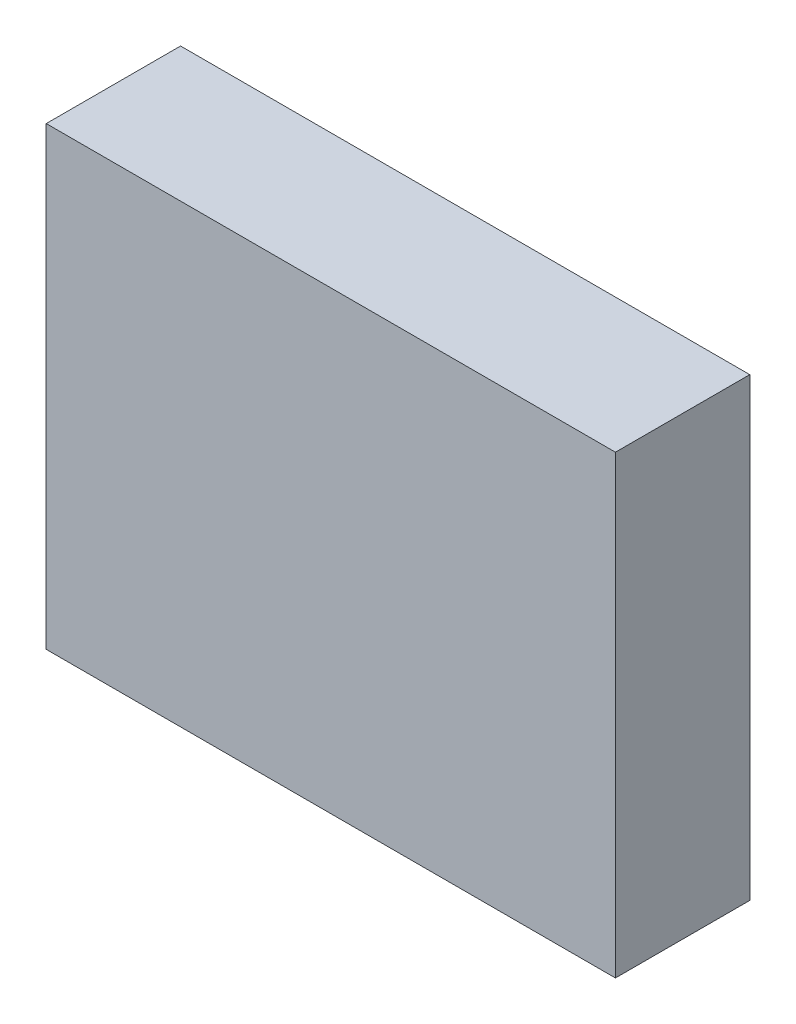
ISO-10303-21;
HEADER;
FILE_DESCRIPTION(('STEP AP214'),'2;1');
FILE_NAME('part.step','',(''),(''),'','','');
FILE_SCHEMA(('AUTOMOTIVE_DESIGN { 1 0 10303 214 1 1 1 1 }'));
ENDSEC;
DATA;
#1=APPLICATION_CONTEXT('core data for automotive mechanical design processes');
#2=APPLICATION_PROTOCOL_DEFINITION('international standard','automotive_design',2000,#1);
#3=PRODUCT_CONTEXT('',#1,'mechanical');
#4=PRODUCT('Part','Part','',(#3));
#5=PRODUCT_RELATED_PRODUCT_CATEGORY('part','',(#4));
#6=PRODUCT_DEFINITION_FORMATION('','',#4);
#7=PRODUCT_DEFINITION_CONTEXT('part definition',#1,'design');
#8=PRODUCT_DEFINITION('design','',#6,#7);
#9=PRODUCT_DEFINITION_SHAPE('','',#8);
#10=(LENGTH_UNIT() NAMED_UNIT(*) SI_UNIT(.MILLI.,.METRE.));
#11=(NAMED_UNIT(*) PLANE_ANGLE_UNIT() SI_UNIT($,.RADIAN.));
#12=(NAMED_UNIT(*) SI_UNIT($,.STERADIAN.) SOLID_ANGLE_UNIT());
#13=UNCERTAINTY_MEASURE_WITH_UNIT(LENGTH_MEASURE(1.E-05),#10,'distance_accuracy_value','');
#14=(GEOMETRIC_REPRESENTATION_CONTEXT(3) GLOBAL_UNCERTAINTY_ASSIGNED_CONTEXT((#13)) GLOBAL_UNIT_ASSIGNED_CONTEXT((#10,
#11,#12)) REPRESENTATION_CONTEXT('',''));
#15=CARTESIAN_POINT('',(0.,0.,0.));
#16=DIRECTION('',(0.,0.,1.));
#17=DIRECTION('',(1.,0.,0.));
#18=AXIS2_PLACEMENT_3D('',#15,#16,#17);
#19=CARTESIAN_POINT('',(-0.62500002,0.50000154,0.29499814));
#20=DIRECTION('',(0.,0.,1.));
#21=DIRECTION('',(1.,0.,0.));
#22=AXIS2_PLACEMENT_3D('',#19,#20,#21);
#23=PLANE('',#22);
#24=DIRECTION('',(0.,1.,0.));
#25=VECTOR('',#24,1.);
#26=CARTESIAN_POINT('',(0.62500002,0.50000154,0.29499814));
#27=LINE('',#26,#25);
#28=CARTESIAN_POINT('',(0.62500002,0.50000154,0.29499814));
#29=VERTEX_POINT('',#28);
#30=CARTESIAN_POINT('',(0.62500002,-0.499999,0.29499814));
#31=VERTEX_POINT('',#30);
#32=EDGE_CURVE('E52',#29,#31,#27,.F.);
#33=ORIENTED_EDGE('',*,*,#32,.F.);
#34=DIRECTION('',(1.,0.,0.));
#35=VECTOR('',#34,1.);
#36=CARTESIAN_POINT('',(-0.62500002,0.50000154,0.29499814));
#37=LINE('',#36,#35);
#38=CARTESIAN_POINT('',(-0.62500002,0.50000154,0.29499814));
#39=VERTEX_POINT('',#38);
#40=EDGE_CURVE('E67',#39,#29,#37,.T.);
#41=ORIENTED_EDGE('',*,*,#40,.F.);
#42=DIRECTION('',(0.,1.,0.));
#43=VECTOR('',#42,1.);
#44=CARTESIAN_POINT('',(-0.62500002,-0.499999,0.29499814));
#45=LINE('',#44,#43);
#46=CARTESIAN_POINT('',(-0.62500002,-0.499999,0.29499814));
#47=VERTEX_POINT('',#46);
#48=EDGE_CURVE('E19',#47,#39,#45,.T.);
#49=ORIENTED_EDGE('',*,*,#48,.F.);
#50=DIRECTION('',(1.,0.,0.));
#51=VECTOR('',#50,1.);
#52=CARTESIAN_POINT('',(0.62500002,-0.499999,0.29499814));
#53=LINE('',#52,#51);
#54=EDGE_CURVE('E57',#31,#47,#53,.F.);
#55=ORIENTED_EDGE('',*,*,#54,.F.);
#56=EDGE_LOOP('',(#33,#41,#49,#55));
#57=FACE_BOUND('',#56,.T.);
#58=ADVANCED_FACE('F16',(#57),#23,.T.);
#59=CARTESIAN_POINT('',(-0.62500002,-0.499999,0.));
#60=DIRECTION('',(-1.,0.,0.));
#61=DIRECTION('',(0.,0.,1.));
#62=AXIS2_PLACEMENT_3D('',#59,#60,#61);
#63=PLANE('',#62);
#64=DIRECTION('',(0.,0.,1.));
#65=VECTOR('',#64,1.);
#66=CARTESIAN_POINT('',(-0.62500002,0.50000154,0.));
#67=LINE('',#66,#65);
#68=CARTESIAN_POINT('',(-0.62500002,0.50000154,0.));
#69=VERTEX_POINT('',#68);
#70=EDGE_CURVE('E78',#69,#39,#67,.T.);
#71=ORIENTED_EDGE('',*,*,#70,.F.);
#72=DIRECTION('',(0.,1.,0.));
#73=VECTOR('',#72,1.);
#74=CARTESIAN_POINT('',(-0.62500002,0.50000154,0.));
#75=LINE('',#74,#73);
#76=CARTESIAN_POINT('',(-0.62500002,-0.499999,0.));
#77=VERTEX_POINT('',#76);
#78=EDGE_CURVE('E73',#69,#77,#75,.F.);
#79=ORIENTED_EDGE('',*,*,#78,.T.);
#80=DIRECTION('',(0.,0.,-1.));
#81=VECTOR('',#80,1.);
#82=CARTESIAN_POINT('',(-0.62500002,-0.499999,0.));
#83=LINE('',#82,#81);
#84=EDGE_CURVE('E62',#47,#77,#83,.T.);
#85=ORIENTED_EDGE('',*,*,#84,.F.);
#86=ORIENTED_EDGE('',*,*,#48,.T.);
#87=EDGE_LOOP('',(#71,#79,#85,#86));
#88=FACE_BOUND('',#87,.T.);
#89=ADVANCED_FACE('F72',(#88),#63,.T.);
#90=CARTESIAN_POINT('',(0.62500002,-0.499999,0.));
#91=DIRECTION('',(0.,-1.,0.));
#92=DIRECTION('',(0.,0.,-1.));
#93=AXIS2_PLACEMENT_3D('',#90,#91,#92);
#94=PLANE('',#93);
#95=ORIENTED_EDGE('',*,*,#84,.T.);
#96=DIRECTION('',(1.,0.,0.));
#97=VECTOR('',#96,1.);
#98=CARTESIAN_POINT('',(-0.62500002,-0.499999,0.));
#99=LINE('',#98,#97);
#100=CARTESIAN_POINT('',(0.62500002,-0.499999,0.));
#101=VERTEX_POINT('',#100);
#102=EDGE_CURVE('E83',#77,#101,#99,.T.);
#103=ORIENTED_EDGE('',*,*,#102,.T.);
#104=DIRECTION('',(0.,0.,-1.));
#105=VECTOR('',#104,1.);
#106=CARTESIAN_POINT('',(0.62500002,-0.499999,0.));
#107=LINE('',#106,#105);
#108=EDGE_CURVE('E64',#31,#101,#107,.T.);
#109=ORIENTED_EDGE('',*,*,#108,.F.);
#110=ORIENTED_EDGE('',*,*,#54,.T.);
#111=EDGE_LOOP('',(#95,#103,#109,#110));
#112=FACE_BOUND('',#111,.T.);
#113=ADVANCED_FACE('F59',(#112),#94,.T.);
#114=CARTESIAN_POINT('',(0.62500002,0.50000154,0.));
#115=DIRECTION('',(1.,0.,0.));
#116=DIRECTION('',(0.,0.,-1.));
#117=AXIS2_PLACEMENT_3D('',#114,#115,#116);
#118=PLANE('',#117);
#119=ORIENTED_EDGE('',*,*,#108,.T.);
#120=DIRECTION('',(0.,1.,0.));
#121=VECTOR('',#120,1.);
#122=CARTESIAN_POINT('',(0.62500002,0.50000154,0.));
#123=LINE('',#122,#121);
#124=CARTESIAN_POINT('',(0.62500002,0.50000154,0.));
#125=VERTEX_POINT('',#124);
#126=EDGE_CURVE('E25',#101,#125,#123,.T.);
#127=ORIENTED_EDGE('',*,*,#126,.T.);
#128=DIRECTION('',(0.,0.,1.));
#129=VECTOR('',#128,1.);
#130=CARTESIAN_POINT('',(0.62500002,0.50000154,0.));
#131=LINE('',#130,#129);
#132=EDGE_CURVE('E33',#29,#125,#131,.F.);
#133=ORIENTED_EDGE('',*,*,#132,.F.);
#134=ORIENTED_EDGE('',*,*,#32,.T.);
#135=EDGE_LOOP('',(#119,#127,#133,#134));
#136=FACE_BOUND('',#135,.T.);
#137=ADVANCED_FACE('F87',(#136),#118,.T.);
#138=CARTESIAN_POINT('',(-0.62500002,0.50000154,0.));
#139=DIRECTION('',(0.,1.,0.));
#140=DIRECTION('',(0.,0.,1.));
#141=AXIS2_PLACEMENT_3D('',#138,#139,#140);
#142=PLANE('',#141);
#143=ORIENTED_EDGE('',*,*,#132,.T.);
#144=DIRECTION('',(1.,0.,0.));
#145=VECTOR('',#144,1.);
#146=CARTESIAN_POINT('',(-0.62500002,0.50000154,0.));
#147=LINE('',#146,#145);
#148=EDGE_CURVE('E11',#125,#69,#147,.F.);
#149=ORIENTED_EDGE('',*,*,#148,.T.);
#150=ORIENTED_EDGE('',*,*,#70,.T.);
#151=ORIENTED_EDGE('',*,*,#40,.T.);
#152=EDGE_LOOP('',(#143,#149,#150,#151));
#153=FACE_BOUND('',#152,.T.);
#154=ADVANCED_FACE('F90',(#153),#142,.T.);
#155=CARTESIAN_POINT('',(-0.62500002,0.50000154,0.));
#156=DIRECTION('',(0.,0.,1.));
#157=DIRECTION('',(1.,0.,0.));
#158=AXIS2_PLACEMENT_3D('',#155,#156,#157);
#159=PLANE('',#158);
#160=ORIENTED_EDGE('',*,*,#126,.F.);
#161=ORIENTED_EDGE('',*,*,#102,.F.);
#162=ORIENTED_EDGE('',*,*,#78,.F.);
#163=ORIENTED_EDGE('',*,*,#148,.F.);
#164=EDGE_LOOP('',(#160,#161,#162,#163));
#165=FACE_BOUND('',#164,.T.);
#166=ADVANCED_FACE('F89',(#165),#159,.F.);
#167=CLOSED_SHELL('',(#58,#89,#113,#137,#154,#166));
#168=MANIFOLD_SOLID_BREP('B1',#167);
#169=ADVANCED_BREP_SHAPE_REPRESENTATION('',(#18,#168),#14);
#170=SHAPE_DEFINITION_REPRESENTATION(#9,#169);
ENDSEC;
END-ISO-10303-21;
